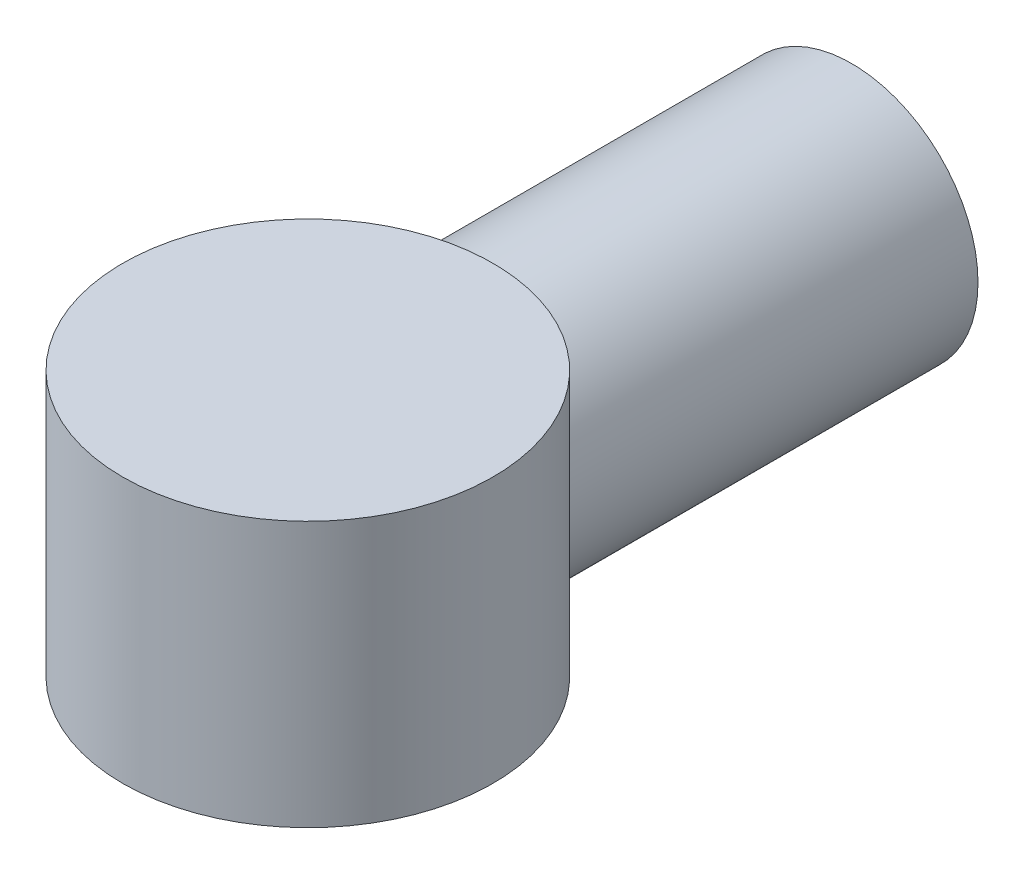
ISO-10303-21;
HEADER;
FILE_DESCRIPTION(('STEP AP214'),'2;1');
FILE_NAME('part.step','',(''),(''),'','','');
FILE_SCHEMA(('AUTOMOTIVE_DESIGN { 1 0 10303 214 1 1 1 1 }'));
ENDSEC;
DATA;
#1=APPLICATION_CONTEXT('core data for automotive mechanical design processes');
#2=APPLICATION_PROTOCOL_DEFINITION('international standard','automotive_design',2000,#1);
#3=PRODUCT_CONTEXT('',#1,'mechanical');
#4=PRODUCT('Part','Part','',(#3));
#5=PRODUCT_RELATED_PRODUCT_CATEGORY('part','',(#4));
#6=PRODUCT_DEFINITION_FORMATION('','',#4);
#7=PRODUCT_DEFINITION_CONTEXT('part definition',#1,'design');
#8=PRODUCT_DEFINITION('design','',#6,#7);
#9=PRODUCT_DEFINITION_SHAPE('','',#8);
#10=(LENGTH_UNIT() NAMED_UNIT(*) SI_UNIT(.MILLI.,.METRE.));
#11=(NAMED_UNIT(*) PLANE_ANGLE_UNIT() SI_UNIT($,.RADIAN.));
#12=(NAMED_UNIT(*) SI_UNIT($,.STERADIAN.) SOLID_ANGLE_UNIT());
#13=UNCERTAINTY_MEASURE_WITH_UNIT(LENGTH_MEASURE(1.E-05),#10,'distance_accuracy_value','');
#14=(GEOMETRIC_REPRESENTATION_CONTEXT(3) GLOBAL_UNCERTAINTY_ASSIGNED_CONTEXT((#13)) GLOBAL_UNIT_ASSIGNED_CONTEXT((#10,
#11,#12)) REPRESENTATION_CONTEXT('',''));
#15=CARTESIAN_POINT('',(0.,0.,0.));
#16=DIRECTION('',(0.,0.,1.));
#17=DIRECTION('',(1.,0.,0.));
#18=AXIS2_PLACEMENT_3D('',#15,#16,#17);
#19=CARTESIAN_POINT('',(0.,25.,102.473472637417));
#20=DIRECTION('',(0.,-1.,0.));
#21=DIRECTION('',(0.,0.,-1.));
#22=AXIS2_PLACEMENT_3D('',#19,#20,#21);
#23=CYLINDRICAL_SURFACE('',#22,34.8869608064512);
#24=CARTESIAN_POINT('',(0.,25.,102.473472637417));
#25=DIRECTION('',(0.,1.,0.));
#26=DIRECTION('',(0.,0.,1.));
#27=AXIS2_PLACEMENT_3D('',#24,#25,#26);
#28=CIRCLE('',#27,34.8869608064512);
#29=CARTESIAN_POINT('',(0.,25.,137.360433443868));
#30=VERTEX_POINT('',#29);
#31=EDGE_CURVE('E92',#30,#30,#28,.T.);
#32=ORIENTED_EDGE('',*,*,#31,.F.);
#33=EDGE_LOOP('',(#32));
#34=FACE_BOUND('',#33,.T.);
#35=CARTESIAN_POINT('',(0.,-25.,102.473472637417));
#36=DIRECTION('',(0.,1.,0.));
#37=DIRECTION('',(0.,0.,1.));
#38=AXIS2_PLACEMENT_3D('',#35,#36,#37);
#39=CIRCLE('',#38,34.8869608064512);
#40=CARTESIAN_POINT('',(0.,-25.,137.360433443868));
#41=VERTEX_POINT('',#40);
#42=EDGE_CURVE('E61',#41,#41,#39,.T.);
#43=ORIENTED_EDGE('',*,*,#42,.T.);
#44=EDGE_LOOP('',(#43));
#45=FACE_BOUND('',#44,.T.);
#46=CARTESIAN_POINT('',(-23.8,0.,76.9654340160164));
#47=CARTESIAN_POINT('',(-23.7999934232789,-0.576418801419144,76.9654224864551));
#48=CARTESIAN_POINT('',(-23.7790111165442,-1.1529411964045,76.9458005797443));
#49=CARTESIAN_POINT('',(-23.6955530417179,-2.30042789828507,76.8683186910635));
#50=CARTESIAN_POINT('',(-23.6330666952308,-2.8713907505308,76.8104489606488));
#51=CARTESIAN_POINT('',(-23.4678171923389,-4.00369020930131,76.6592501365312));
#52=CARTESIAN_POINT('',(-23.3649815951806,-4.56500759637919,76.5658572758954));
#53=CARTESIAN_POINT('',(-23.1209751010125,-5.67295265167801,76.3478681553006));
#54=CARTESIAN_POINT('',(-22.9798041055056,-6.21958028215185,76.2232718151688));
#55=CARTESIAN_POINT('',(-22.6629692548293,-7.28957490482201,75.9492726224235));
#56=CARTESIAN_POINT('',(-22.4876875019501,-7.81312723235293,75.8001471695467));
#57=CARTESIAN_POINT('',(-22.1036800383326,-8.84129983418151,75.4810727479273));
#58=CARTESIAN_POINT('',(-21.8949485950122,-9.34591684503167,75.3111202110321));
#59=CARTESIAN_POINT('',(-21.4458738152125,-10.3348634444718,74.9551772068326));
#60=CARTESIAN_POINT('',(-21.2055349141294,-10.8191958669979,74.7691889910343));
#61=CARTESIAN_POINT('',(-20.6947030232115,-11.7668631252132,74.3855507525045));
#62=CARTESIAN_POINT('',(-20.42420796103,-12.2301965147568,74.1878999287525));
#63=CARTESIAN_POINT('',(-19.8073785273959,-13.2096775066613,73.751827716536));
#64=CARTESIAN_POINT('',(-19.4558878071528,-13.7219785126137,73.5120472272838));
#65=CARTESIAN_POINT('',(-18.7151454002358,-14.7162391510908,73.0279433148781));
#66=CARTESIAN_POINT('',(-18.3258909859813,-15.1981965878206,72.7836195646077));
#67=CARTESIAN_POINT('',(-17.5103725108963,-16.1310584132851,72.2954515535117));
#68=CARTESIAN_POINT('',(-17.084068950002,-16.5819287170611,72.0516080950594));
#69=CARTESIAN_POINT('',(-16.1958736215276,-17.450488511825,71.5696039212662));
#70=CARTESIAN_POINT('',(-15.7339795742253,-17.8681758738179,71.3314435712343));
#71=CARTESIAN_POINT('',(-14.7014037081394,-18.7304137333746,70.8294017930397));
#72=CARTESIAN_POINT('',(-14.1249532477419,-19.16910365332,70.5672504429124));
#73=CARTESIAN_POINT('',(-12.9280824386725,-19.9958457298979,70.0638072343948));
#74=CARTESIAN_POINT('',(-12.3076545774704,-20.3838892024214,69.8225189556852));
#75=CARTESIAN_POINT('',(-11.026616307814,-21.1043236405197,69.3679670011689));
#76=CARTESIAN_POINT('',(-10.366068847461,-21.4367988673429,69.1546610018885));
#77=CARTESIAN_POINT('',(-9.34817424997351,-21.8904026671497,68.8604302193373));
#78=CARTESIAN_POINT('',(-9.00439806679816,-22.0340741495979,68.7666490848259));
#79=CARTESIAN_POINT('',(-8.30827765558709,-22.3058769027705,68.5883484701637));
#80=CARTESIAN_POINT('',(-7.95593131729409,-22.4340042985538,68.5038312999048));
#81=CARTESIAN_POINT('',(-7.07131721274117,-22.7320750284092,68.3063915983178));
#82=CARTESIAN_POINT('',(-6.53438113875734,-22.8923067623107,68.1994778877456));
#83=CARTESIAN_POINT('',(-5.44663349796937,-23.1752011828725,68.0098835953698));
#84=CARTESIAN_POINT('',(-4.89582475680757,-23.297871454294,67.9271981213197));
#85=CARTESIAN_POINT('',(-3.78400179446113,-23.5040581134994,67.7878126969488));
#86=CARTESIAN_POINT('',(-3.2229940030479,-23.5875983376159,67.7310969274806));
#87=CARTESIAN_POINT('',(-2.09434462225598,-23.7144725466885,67.6448339290833));
#88=CARTESIAN_POINT('',(-1.5267028130228,-23.7578051952988,67.6152876031628));
#89=CARTESIAN_POINT('',(-0.388011994390582,-23.8036694258833,67.5840125116054));
#90=CARTESIAN_POINT('',(0.183041219845814,-23.8061300284291,67.5823321386954));
#91=CARTESIAN_POINT('',(1.32323603275077,-23.7700313219602,67.6069521512566));
#92=CARTESIAN_POINT('',(1.89237763851074,-23.7314721652837,67.633252432814));
#93=CARTESIAN_POINT('',(3.02464219352566,-23.6138857493737,67.7132398737084));
#94=CARTESIAN_POINT('',(3.58776365336006,-23.5348487018522,67.7669336572789));
#95=CARTESIAN_POINT('',(4.70388069239944,-23.3374099811244,67.9005141360662));
#96=CARTESIAN_POINT('',(5.25687624094778,-23.2190081887604,67.9804009105696));
#97=CARTESIAN_POINT('',(6.33872572701026,-22.9470196826576,68.1628942983544));
#98=CARTESIAN_POINT('',(6.8678391539846,-22.7941498262457,68.2650367605406));
#99=CARTESIAN_POINT('',(7.91002706024392,-22.4537746582396,68.4908914563474));
#100=CARTESIAN_POINT('',(8.4231018532541,-22.2662700246185,68.614603267747));
#101=CARTESIAN_POINT('',(9.43087569518658,-21.8585017677894,68.8813551872887));
#102=CARTESIAN_POINT('',(9.92557359306053,-21.6382360968826,69.0243965035527));
#103=CARTESIAN_POINT('',(10.8946720655486,-21.166873069215,69.3273724597381));
#104=CARTESIAN_POINT('',(11.3690714309199,-20.9157738790502,69.4873081041408));
#105=CARTESIAN_POINT('',(12.3483078153223,-20.3546700619999,69.8403630774304));
#106=CARTESIAN_POINT('',(12.8505529617971,-20.0412161757087,70.0351909414737));
#107=CARTESIAN_POINT('',(13.8264830282277,-19.380804964732,70.4390012663528));
#108=CARTESIAN_POINT('',(14.3001661274048,-19.0338455077873,70.6479846277764));
#109=CARTESIAN_POINT('',(15.2182390036362,-18.3081383559605,71.0766236441966));
#110=CARTESIAN_POINT('',(15.6625987483969,-17.9293589470871,71.2962898524318));
#111=CARTESIAN_POINT('',(16.5205469468131,-17.142070068087,71.7422935444564));
#112=CARTESIAN_POINT('',(16.9341338594714,-16.7335591111305,71.9686313615457));
#113=CARTESIAN_POINT('',(17.7976142375337,-15.8160260674958,72.4629282957196));
#114=CARTESIAN_POINT('',(18.2416530524689,-15.3017504505741,72.731396727088));
#115=CARTESIAN_POINT('',(19.0849393108366,-14.2361151224849,73.2653522812956));
#116=CARTESIAN_POINT('',(19.4841777806016,-13.6847480170119,73.5308387972971));
#117=CARTESIAN_POINT('',(20.2359085468255,-12.5464308029138,74.0513535408443));
#118=CARTESIAN_POINT('',(20.5884156874895,-11.9594920803528,74.3063850715488));
#119=CARTESIAN_POINT('',(21.0802146355364,-11.0536216275783,74.6747923714575));
#120=CARTESIAN_POINT('',(21.2379741645693,-10.7474512114712,74.7952274276563));
#121=CARTESIAN_POINT('',(21.5408959020612,-10.1266541785027,75.0303207943079));
#122=CARTESIAN_POINT('',(21.6860549962364,-9.81202549614617,75.1449776737243));
#123=CARTESIAN_POINT('',(22.0363551154858,-9.00669786344431,75.4258722331339));
#124=CARTESIAN_POINT('',(22.2328176809062,-8.51054799640187,75.5874687807705));
#125=CARTESIAN_POINT('',(22.5935382672858,-7.50062973781419,75.8898781260107));
#126=CARTESIAN_POINT('',(22.7578044848251,-6.98686586969414,76.0306962111548));
#127=CARTESIAN_POINT('',(23.0521001813054,-5.94420660658114,76.2868583049628));
#128=CARTESIAN_POINT('',(23.1821805744406,-5.4153350296134,76.4022401549563));
#129=CARTESIAN_POINT('',(23.4065146859012,-4.3444535921483,76.6034535830092));
#130=CARTESIAN_POINT('',(23.5007687655733,-3.80244386422189,76.6892854591108));
#131=CARTESIAN_POINT('',(23.6524247807304,-2.70419582407584,76.8283250164302));
#132=CARTESIAN_POINT('',(23.7094986173644,-2.14787470417389,76.881242059334));
#133=CARTESIAN_POINT('',(23.7842815130469,-1.03030857033748,76.9507251154809));
#134=CARTESIAN_POINT('',(23.8019914464091,-0.469063666043406,76.9672919361006));
#135=CARTESIAN_POINT('',(23.7976527066048,0.653119380017923,76.9632440790626));
#136=CARTESIAN_POINT('',(23.7756048783285,1.21405752805064,76.9426301915303));
#137=CARTESIAN_POINT('',(23.6922414729451,2.33045411274277,76.8652527139465));
#138=CARTESIAN_POINT('',(23.630926840338,2.88591268087836,76.8084899933972));
#139=CARTESIAN_POINT('',(23.4797373200805,3.92213665353809,76.6701576689596));
#140=CARTESIAN_POINT('',(23.3940546053934,4.40402291016964,76.5922775150484));
#141=CARTESIAN_POINT('',(23.1942603637191,5.35758087067876,76.4130751229642));
#142=CARTESIAN_POINT('',(23.0801384992749,5.82924879234222,76.311744361596));
#143=CARTESIAN_POINT('',(22.8247577699404,6.76044932188342,76.0886440734891));
#144=CARTESIAN_POINT('',(22.683485643929,7.21997587422256,75.9668645625636));
#145=CARTESIAN_POINT('',(22.3751617213182,8.12532626198566,75.7060867295689));
#146=CARTESIAN_POINT('',(22.2081041883875,8.57114702183173,75.5670845774384));
#147=CARTESIAN_POINT('',(21.7676576972424,9.64804628956608,75.2084333248268));
#148=CARTESIAN_POINT('',(21.480514696295,10.2709202876238,74.9809085702822));
#149=CARTESIAN_POINT('',(20.8574299037837,11.4835837808781,74.5052525023245));
#150=CARTESIAN_POINT('',(20.5214697042056,12.0733606789931,74.2571134308379));
#151=CARTESIAN_POINT('',(19.8027323711794,13.2193008654367,73.7481172166431));
#152=CARTESIAN_POINT('',(19.4198811731219,13.775408848522,73.4872403556759));
#153=CARTESIAN_POINT('',(18.6097503941218,14.8516259763897,72.9605830442137));
#154=CARTESIAN_POINT('',(18.1824757158153,15.3717390830858,72.694803137483));
#155=CARTESIAN_POINT('',(17.2783306182021,16.381864046943,72.1611160958106));
#156=CARTESIAN_POINT('',(16.8008215639262,16.8713186838608,71.8932354167575));
#157=CARTESIAN_POINT('',(15.8029197277101,17.8094548626322,71.3658164668987));
#158=CARTESIAN_POINT('',(15.2825237796367,18.2581333890306,71.1062788139881));
#159=CARTESIAN_POINT('',(14.2011651366375,19.111267045626,70.6021321185891));
#160=CARTESIAN_POINT('',(13.6402589248925,19.5157818480859,70.3575031347296));
#161=CARTESIAN_POINT('',(12.4792953905597,20.277796559249,69.8888314807337));
#162=CARTESIAN_POINT('',(11.8792463557827,20.6353063724095,69.6647844767599));
#163=CARTESIAN_POINT('',(10.7505102967853,21.2415253225651,69.2798340154042));
#164=CARTESIAN_POINT('',(10.2275969162308,21.4983391268409,69.1147293724773));
#165=CARTESIAN_POINT('',(9.15907423957206,21.9748362980094,68.8056754965813));
#166=CARTESIAN_POINT('',(8.61346735390059,22.1945235958764,68.6617240241143));
#167=CARTESIAN_POINT('',(7.50250207252844,22.5942643938575,68.397993682423));
#168=CARTESIAN_POINT('',(6.93715282474016,22.7743359753847,68.2782037874522));
#169=CARTESIAN_POINT('',(5.7898348835558,23.092686860989,68.0653602214691));
#170=CARTESIAN_POINT('',(5.2078659924592,23.2309656676893,67.9723068686496));
#171=CARTESIAN_POINT('',(4.02839050368072,23.4643400347754,67.8147388140668));
#172=CARTESIAN_POINT('',(3.43082037668806,23.5592144289078,67.7503703175464));
#173=CARTESIAN_POINT('',(2.22766767264948,23.7032602523401,67.6524763561897));
#174=CARTESIAN_POINT('',(1.62208507651964,23.7524315727655,67.6189509648282));
#175=CARTESIAN_POINT('',(0.408117089163109,23.8042533327557,67.5836152068813));
#176=CARTESIAN_POINT('',(-0.20026775994007,23.8069124212439,67.5817989440012));
#177=CARTESIAN_POINT('',(-1.4146938105416,23.7656836728401,67.6099168754353));
#178=CARTESIAN_POINT('',(-2.02073514502577,23.7217985172506,67.6398492407868));
#179=CARTESIAN_POINT('',(-3.17511174789239,23.5937983487534,67.7268846208052));
#180=CARTESIAN_POINT('',(-3.72404606060242,23.5133418707181,67.7815146793293));
#181=CARTESIAN_POINT('',(-4.81198123834891,23.3150281410025,67.9156192224869));
#182=CARTESIAN_POINT('',(-5.35098275874637,23.1971733662602,67.9950920617452));
#183=CARTESIAN_POINT('',(-6.41586466746145,22.9255032874084,68.1772835021058));
#184=CARTESIAN_POINT('',(-6.94174347366962,22.7716836702424,68.2800048912253));
#185=CARTESIAN_POINT('',(-7.97752988333861,22.4298127928596,68.5067216358073));
#186=CARTESIAN_POINT('',(-8.48743665704361,22.2417597576436,68.6307180943606));
#187=CARTESIAN_POINT('',(-9.51318226811926,21.8234011335735,68.9042216856573));
#188=CARTESIAN_POINT('',(-10.028113813175,21.5914910926157,69.0546730400648));
#189=CARTESIAN_POINT('',(-11.0357028008993,21.0942867455731,69.3737352176746));
#190=CARTESIAN_POINT('',(-11.5283597984137,20.8289917726949,69.5423464035714));
#191=CARTESIAN_POINT('',(-12.4897842709057,20.2670999571635,69.8948370589099));
#192=CARTESIAN_POINT('',(-12.9585501726249,19.9705010570472,70.078717531762));
#193=CARTESIAN_POINT('',(-13.8709383481807,19.3479239588065,70.4587666137434));
#194=CARTESIAN_POINT('',(-14.3145576644838,19.0219423165565,70.6549366625827));
#195=CARTESIAN_POINT('',(-15.2435209437302,18.2887460018305,71.0881660727127));
#196=CARTESIAN_POINT('',(-15.7244237818005,17.8768253109132,71.3267975025266));
#197=CARTESIAN_POINT('',(-16.649970269136,17.0181400831517,71.8115824508825));
#198=CARTESIAN_POINT('',(-17.0946105434641,16.5713723106617,72.057736666642));
#199=CARTESIAN_POINT('',(-17.9474288694022,15.643771264855,72.5530203628534));
#200=CARTESIAN_POINT('',(-18.3555262701828,15.1628666469621,72.802155112344));
#201=CARTESIAN_POINT('',(-19.13298135753,14.169228331962,73.2974288529415));
#202=CARTESIAN_POINT('',(-19.5023372516065,13.6564931638661,73.5435677049689));
#203=CARTESIAN_POINT('',(-20.2481543595092,12.5287269154313,74.0596610284473));
#204=CARTESIAN_POINT('',(-20.6188113339861,11.9092429952493,74.3283300110698));
#205=CARTESIAN_POINT('',(-21.3055393683675,10.6320262303014,74.8445266967597));
#206=CARTESIAN_POINT('',(-21.6215944929223,9.97428229410221,75.0920482174004));
#207=CARTESIAN_POINT('',(-22.1942627831652,8.62492903321618,75.5541531477789));
#208=CARTESIAN_POINT('',(-22.4510835525252,7.9334486025017,75.768850677943));
#209=CARTESIAN_POINT('',(-22.7891082531988,6.8727214099843,76.0579742661914));
#210=CARTESIAN_POINT('',(-22.8938995067005,6.51530022333918,76.1488471015774));
#211=CARTESIAN_POINT('',(-23.087188312846,5.79321564804224,76.3182001152579));
#212=CARTESIAN_POINT('',(-23.1756888665667,5.42855360704308,76.3966825757304));
#213=CARTESIAN_POINT('',(-23.3450824994391,4.65012375833467,76.548165320795));
#214=CARTESIAN_POINT('',(-23.4238996599105,4.23556984102833,76.6194714340324));
#215=CARTESIAN_POINT('',(-23.5596848166813,3.40005650726203,76.7431455328398));
#216=CARTESIAN_POINT('',(-23.6166513574851,2.979096666037,76.7955122568214));
#217=CARTESIAN_POINT('',(-23.7080525563766,2.13288920553287,76.8798762181874));
#218=CARTESIAN_POINT('',(-23.7424979886499,1.70764373553374,76.9118831955544));
#219=CARTESIAN_POINT('',(-23.7884720075606,0.854950886617269,76.9546643856077));
#220=CARTESIAN_POINT('',(-23.8000048776587,0.427503934246384,76.9654425669743));
#221=CARTESIAN_POINT('',(-23.8,0.,76.9654340160164));
#222=B_SPLINE_CURVE_WITH_KNOTS('',3,(#46,#47,#48,#49,#50,#51,#52,#53,#54,#55,#56,#57,#58,#59,
#60,#61,#62,#63,#64,#65,#66,#67,#68,#69,#70,#71,#72,#73,#74,#75,#76,#77,#78,#79,#80,#81,#82,#83,
#84,#85,#86,#87,#88,#89,#90,#91,#92,#93,#94,#95,#96,#97,#98,#99,#100,#101,#102,#103,#104,#105,
#106,#107,#108,#109,#110,#111,#112,#113,#114,#115,#116,#117,#118,#119,#120,#121,#122,#123,#124,
#125,#126,#127,#128,#129,#130,#131,#132,#133,#134,#135,#136,#137,#138,#139,#140,#141,#142,#143,
#144,#145,#146,#147,#148,#149,#150,#151,#152,#153,#154,#155,#156,#157,#158,#159,#160,#161,#162,
#163,#164,#165,#166,#167,#168,#169,#170,#171,#172,#173,#174,#175,#176,#177,#178,#179,#180,#181,
#182,#183,#184,#185,#186,#187,#188,#189,#190,#191,#192,#193,#194,#195,#196,#197,#198,#199,#200,
#201,#202,#203,#204,#205,#206,#207,#208,#209,#210,#211,#212,#213,#214,#215,#216,#217,#218,#219,
#220,#221),.UNSPECIFIED.,.T.,.F.,(4,2,2,2,2,2,2,2,2,2,2,2,2,2,2,2,2,2,2,2,2,2,2,2,2,2,2,2,2,2,2,
2,2,2,2,2,2,2,2,2,2,2,2,2,2,2,2,2,2,2,2,2,2,2,2,2,2,2,2,2,2,2,2,2,2,2,2,2,2,2,2,2,2,2,2,2,2,2,2,
2,2,2,2,2,2,2,2,4),(0.,1.72873561587331,3.45791201462044,5.19020718897562,6.92250681424603,
8.63641559826065,10.3506184253807,12.0645809588391,13.7786613493665,15.7746497489281,
17.77078242141,19.7690700160479,21.7674857160884,24.0754498214858,26.3838091442289,
28.6886357751461,29.8408282201133,30.9933073042085,32.7026866286872,34.411720551357,
36.1197120461878,37.8277603060878,39.5387744962662,41.2497823321454,42.9612041162408,
44.6726310808839,46.3512994949207,48.0299350526353,49.7086755760635,51.387515968123,
53.2554894928936,55.1235819719729,56.9935589292416,58.8636294655681,61.0529367471517,
63.2426817748918,65.4317295549531,66.5260466804873,67.6206335084412,69.2917620550382,
70.9624646097958,72.6306646415606,74.2988478472994,75.9815594628825,77.6642337033026,
79.346872185717,81.0294701964863,82.5147617910072,84.0005940694729,85.487153932475,
86.9740449798215,89.1388230029146,91.3044194502115,93.4734816838119,95.6423047903223,
97.8431213642296,100.044100559641,102.242068082227,104.439571724618,106.254333536037,
108.068903078961,109.882642689503,111.696403884549,113.51930685059,115.342214159163,
117.16478249554,118.987245843817,120.657787847617,122.328219232323,123.99885104509,
125.669569504633,127.421147543777,129.172760572538,130.924488798544,132.676422622692,
134.704432983453,136.73263187515,138.765202054356,140.797866234978,143.105640215815,
145.41408657841,147.714315039283,148.863979028726,150.013431014348,151.296325122192,
152.579304670299,153.861669986048,155.143795543434),.UNSPECIFIED.);
#223=CARTESIAN_POINT('',(-23.8,0.,76.9654340160164));
#224=VERTEX_POINT('',#223);
#225=EDGE_CURVE('E10',#224,#224,#222,.T.);
#226=ORIENTED_EDGE('',*,*,#225,.T.);
#227=EDGE_LOOP('',(#226));
#228=FACE_BOUND('',#227,.T.);
#229=ADVANCED_FACE('F36',(#34,#45,#228),#23,.T.);
#230=CARTESIAN_POINT('',(0.,25.,102.473472637417));
#231=DIRECTION('',(0.,1.,0.));
#232=DIRECTION('',(0.,0.,1.));
#233=AXIS2_PLACEMENT_3D('',#230,#231,#232);
#234=PLANE('',#233);
#235=ORIENTED_EDGE('',*,*,#31,.T.);
#236=EDGE_LOOP('',(#235));
#237=FACE_BOUND('',#236,.T.);
#238=ADVANCED_FACE('F83',(#237),#234,.T.);
#239=CARTESIAN_POINT('',(0.,-25.,102.473472637417));
#240=DIRECTION('',(0.,1.,0.));
#241=DIRECTION('',(0.,0.,1.));
#242=AXIS2_PLACEMENT_3D('',#239,#240,#241);
#243=PLANE('',#242);
#244=ORIENTED_EDGE('',*,*,#42,.F.);
#245=EDGE_LOOP('',(#244));
#246=FACE_BOUND('',#245,.T.);
#247=ADVANCED_FACE('F69',(#246),#243,.F.);
#248=CARTESIAN_POINT('',(0.,0.,80.));
#249=DIRECTION('',(0.,0.,-1.));
#250=DIRECTION('',(-1.,0.,0.));
#251=AXIS2_PLACEMENT_3D('',#248,#249,#250);
#252=CYLINDRICAL_SURFACE('',#251,23.8);
#253=CARTESIAN_POINT('',(0.,0.,0.));
#254=DIRECTION('',(0.,0.,1.));
#255=DIRECTION('',(1.,0.,0.));
#256=AXIS2_PLACEMENT_3D('',#253,#254,#255);
#257=CIRCLE('',#256,23.8);
#258=CARTESIAN_POINT('',(23.8,0.,0.));
#259=VERTEX_POINT('',#258);
#260=EDGE_CURVE('E50',#259,#259,#257,.T.);
#261=ORIENTED_EDGE('',*,*,#260,.T.);
#262=EDGE_LOOP('',(#261));
#263=FACE_BOUND('',#262,.T.);
#264=ORIENTED_EDGE('',*,*,#225,.F.);
#265=EDGE_LOOP('',(#264));
#266=FACE_BOUND('',#265,.T.);
#267=ADVANCED_FACE('F38',(#263,#266),#252,.T.);
#268=CARTESIAN_POINT('',(0.,0.,80.));
#269=DIRECTION('',(0.,0.,-1.));
#270=DIRECTION('',(-1.,0.,0.));
#271=AXIS2_PLACEMENT_3D('',#268,#269,#270);
#272=CYLINDRICAL_SURFACE('',#271,19.);
#273=CARTESIAN_POINT('',(0.,0.,0.));
#274=DIRECTION('',(0.,0.,1.));
#275=DIRECTION('',(1.,0.,0.));
#276=AXIS2_PLACEMENT_3D('',#273,#274,#275);
#277=CIRCLE('',#276,19.);
#278=CARTESIAN_POINT('',(19.,0.,0.));
#279=VERTEX_POINT('',#278);
#280=EDGE_CURVE('E55',#279,#279,#277,.T.);
#281=ORIENTED_EDGE('',*,*,#280,.F.);
#282=EDGE_LOOP('',(#281));
#283=FACE_BOUND('',#282,.T.);
#284=CARTESIAN_POINT('',(-19.,0.,73.214285459526));
#285=CARTESIAN_POINT('',(-19.0000041221513,-0.488015720927359,73.2142908645628));
#286=CARTESIAN_POINT('',(-18.9811757706332,-0.97598558772951,73.2020364684778));
#287=CARTESIAN_POINT('',(-18.9061599866318,-1.94801667178813,73.1535278133211));
#288=CARTESIAN_POINT('',(-18.8499597284938,-2.43207648941135,73.1172653149338));
#289=CARTESIAN_POINT('',(-18.7009241549055,-3.39296602109567,73.0221017349277));
#290=CARTESIAN_POINT('',(-18.6080345835605,-3.86978393651353,72.9631671293326));
#291=CARTESIAN_POINT('',(-18.3869067059098,-4.81205452008513,72.8248865378558));
#292=CARTESIAN_POINT('',(-18.2586704319365,-5.27750783999552,72.7455417255191));
#293=CARTESIAN_POINT('',(-17.9692725394776,-6.19141348912797,72.5697317048933));
#294=CARTESIAN_POINT('',(-17.8083196914151,-6.63995323609034,72.4733755377545));
#295=CARTESIAN_POINT('',(-17.4545896725056,-7.52081027413803,72.2662000848708));
#296=CARTESIAN_POINT('',(-17.2618121586817,-7.9531273903292,72.1553806432569));
#297=CARTESIAN_POINT('',(-16.8459788240165,-8.79974085012178,71.9223710150822));
#298=CARTESIAN_POINT('',(-16.6229219882485,-9.21403658905323,71.8001804474182));
#299=CARTESIAN_POINT('',(-16.1479734830827,-10.0231256240607,71.5475071431366));
#300=CARTESIAN_POINT('',(-15.8960790318667,-10.4179170333856,71.4170236070796));
#301=CARTESIAN_POINT('',(-15.338437088574,-11.224798801279,71.1375663455688));
#302=CARTESIAN_POINT('',(-15.0298262930886,-11.6347220316918,70.9880422147438));
#303=CARTESIAN_POINT('',(-14.3811347292339,-12.4276006276354,70.6865116954403));
#304=CARTESIAN_POINT('',(-14.0410647579846,-12.8105651667918,70.5345061732436));
#305=CARTESIAN_POINT('',(-13.3306185245426,-13.5483224121037,70.2315144309661));
#306=CARTESIAN_POINT('',(-12.9602197851937,-13.9030938330777,70.0805290583007));
#307=CARTESIAN_POINT('',(-12.1908753074551,-14.582383442922,69.783219054087));
#308=CARTESIAN_POINT('',(-11.7919284815758,-14.9069004782187,69.6368946003955));
#309=CARTESIAN_POINT('',(-10.9325157807846,-15.5496504072302,69.3403523431259));
#310=CARTESIAN_POINT('',(-10.4696966922215,-15.8650721203434,69.1908377591636));
#311=CARTESIAN_POINT('',(-9.5148807406197,-16.4554579623894,68.9054021935031));
#312=CARTESIAN_POINT('',(-9.02288181136197,-16.7304192215146,68.7694821762685));
#313=CARTESIAN_POINT('',(-8.01298853091187,-17.2369051059809,68.5152191275413));
#314=CARTESIAN_POINT('',(-7.49510916269305,-17.4684545031152,68.3968660800191));
#315=CARTESIAN_POINT('',(-6.43688901621778,-17.8854622073848,68.1812298259264));
#316=CARTESIAN_POINT('',(-5.89655116776865,-18.0709265046321,68.0839438812787));
#317=CARTESIAN_POINT('',(-4.84282137841126,-18.3799728861128,67.9205030849909));
#318=CARTESIAN_POINT('',(-4.33084348280659,-18.5073773291344,67.8524520078998));
#319=CARTESIAN_POINT('',(-3.2956605086594,-18.7194468286592,67.7386241993393));
#320=CARTESIAN_POINT('',(-2.77245599237031,-18.8041140203523,67.6928463550841));
#321=CARTESIAN_POINT('',(-1.71960458153653,-18.9294438819067,67.6249273793005));
#322=CARTESIAN_POINT('',(-1.18996189251689,-18.9701338647356,67.6027715769234));
#323=CARTESIAN_POINT('',(-0.128686882392629,-19.0069798409946,67.582713688359));
#324=CARTESIAN_POINT('',(0.402945282251011,-19.0031392658602,67.5848097333729));
#325=CARTESIAN_POINT('',(1.40875960568508,-18.9536873472467,67.611717573998));
#326=CARTESIAN_POINT('',(1.88322591928257,-18.9124134978543,67.6341704775455));
#327=CARTESIAN_POINT('',(2.8264354202514,-18.7946029589354,67.6979830693986));
#328=CARTESIAN_POINT('',(3.29517908529451,-18.7180692335098,67.7393411684478));
#329=CARTESIAN_POINT('',(4.22377504542404,-18.5306264323281,67.8399930325523));
#330=CARTESIAN_POINT('',(4.68362703001316,-18.4197161584384,67.8992874227435));
#331=CARTESIAN_POINT('',(5.59153610015569,-18.1647207328162,68.0344623030178));
#332=CARTESIAN_POINT('',(6.03959272962247,-18.0206343003668,68.1103434334019));
#333=CARTESIAN_POINT('',(6.92622977494919,-17.6989328052828,68.2779582633988));
#334=CARTESIAN_POINT('',(7.36464985017208,-17.5209634064362,68.3698585404557));
#335=CARTESIAN_POINT('',(8.22452167384849,-17.1341622057242,68.5669561034339));
#336=CARTESIAN_POINT('',(8.64597349598088,-16.9253305378862,68.6721533316095));
#337=CARTESIAN_POINT('',(9.47008003905182,-16.4783908767576,68.8937208503312));
#338=CARTESIAN_POINT('',(9.87273098633185,-16.2402770405878,69.0100933697444));
#339=CARTESIAN_POINT('',(10.6575558513503,-15.7363913657645,69.2517151832112));
#340=CARTESIAN_POINT('',(11.039727899789,-15.4706170087705,69.3769652851891));
#341=CARTESIAN_POINT('',(11.8217438771376,-14.8832221509585,69.6476393901331));
#342=CARTESIAN_POINT('',(12.2191354286999,-14.5586685119325,69.7937913219459));
#343=CARTESIAN_POINT('',(12.985478202905,-13.8794652469296,70.0906640763849));
#344=CARTESIAN_POINT('',(13.3544276701852,-13.5248137662347,70.2413851802085));
#345=CARTESIAN_POINT('',(14.062682131967,-12.7868203585149,70.5440277916235));
#346=CARTESIAN_POINT('',(14.4019587738433,-12.4034516273112,70.6959502992739));
#347=CARTESIAN_POINT('',(15.048949372352,-11.6099614863282,70.9971876070557));
#348=CARTESIAN_POINT('',(15.3566619649636,-11.1998389216504,71.1465022942606));
#349=CARTESIAN_POINT('',(15.9637081574717,-10.3184398466432,71.4511420903126));
#350=CARTESIAN_POINT('',(16.2600964688256,-9.84492978660871,71.6058961405759));
#351=CARTESIAN_POINT('',(16.811516151579,-8.87053009777732,71.9027176469765));
#352=CARTESIAN_POINT('',(17.0665441909098,-8.36963826739056,72.0447840805593));
#353=CARTESIAN_POINT('',(17.5324814714216,-7.34364985351143,72.3108453113713));
#354=CARTESIAN_POINT('',(17.7434311872963,-6.81857602063662,72.4348566555756));
#355=CARTESIAN_POINT('',(18.1188041363545,-5.74725374258614,72.6597685737127));
#356=CARTESIAN_POINT('',(18.2832347705363,-5.20100868140818,72.7606728234037));
#357=CARTESIAN_POINT('',(18.5516767780939,-4.13662649841988,72.9276055517591));
#358=CARTESIAN_POINT('',(18.6595001426182,-3.61979094266976,72.995795212927));
#359=CARTESIAN_POINT('',(18.8319684188363,-2.57615814670319,73.105675109284));
#360=CARTESIAN_POINT('',(18.8966160639717,-2.04936153928968,73.1473670220295));
#361=CARTESIAN_POINT('',(18.9815432020858,-0.99120598103193,73.202264425153));
#362=CARTESIAN_POINT('',(19.0018637618811,-0.45985171130706,73.2154962821832));
#363=CARTESIAN_POINT('',(18.9978681586472,0.602589175741591,73.2129005553855));
#364=CARTESIAN_POINT('',(18.9735566097777,1.13367581505588,73.1970759754721));
#365=CARTESIAN_POINT('',(18.8873485908731,2.11554469945233,73.1414048648017));
#366=CARTESIAN_POINT('',(18.8312521624273,2.56706432595124,73.1052710811291));
#367=CARTESIAN_POINT('',(18.6872659001313,3.46292758106421,73.0134416889224));
#368=CARTESIAN_POINT('',(18.5993797313258,3.90727203073908,72.9577483354362));
#369=CARTESIAN_POINT('',(18.392821339931,4.78623473893466,72.8285918282179));
#370=CARTESIAN_POINT('',(18.2741387132879,5.22084965649539,72.7551226698038));
#371=CARTESIAN_POINT('',(18.0072297692263,6.07792465935343,72.5926410814204));
#372=CARTESIAN_POINT('',(17.8590014329547,6.50038391179773,72.5036275893611));
#373=CARTESIAN_POINT('',(17.527387458782,7.34894255730938,72.3084386132641));
#374=CARTESIAN_POINT('',(17.3427725626234,7.77442955925006,72.2016933300945));
#375=CARTESIAN_POINT('',(16.9442381665762,8.60851569843845,71.9768306019355));
#376=CARTESIAN_POINT('',(16.7303065530915,9.01710776341681,71.8587084620836));
#377=CARTESIAN_POINT('',(16.2745368177715,9.81585042377884,71.614010901119));
#378=CARTESIAN_POINT('',(16.0326939414212,10.2059978612287,71.4874340413472));
#379=CARTESIAN_POINT('',(15.5223934190201,10.9665424133945,71.2286780483093));
#380=CARTESIAN_POINT('',(15.2539334493417,11.3369377994411,71.0964984265092));
#381=CARTESIAN_POINT('',(14.648004832381,12.1125629391581,70.8085834889328));
#382=CARTESIAN_POINT('',(14.306287457298,12.5143053029282,70.6523700367601));
#383=CARTESIAN_POINT('',(13.5905958218942,13.2880958123344,70.340184923151));
#384=CARTESIAN_POINT('',(13.2166186936629,13.6601413122298,70.1842132844693));
#385=CARTESIAN_POINT('',(12.4378546896102,14.3728391837311,69.8763071181443));
#386=CARTESIAN_POINT('',(12.0330500372508,14.7134731879163,69.7243749890339));
#387=CARTESIAN_POINT('',(11.1946295519635,15.3610160164467,69.4283833225942));
#388=CARTESIAN_POINT('',(10.7610153603118,15.6679267593634,69.2843233376403));
#389=CARTESIAN_POINT('',(9.84559127705882,16.2596225455175,69.0010258476068));
#390=CARTESIAN_POINT('',(9.36246860880591,16.5426505563966,68.8623473542755));
#391=CARTESIAN_POINT('',(8.36954373856005,17.0665109640874,68.6014453908181));
#392=CARTESIAN_POINT('',(7.85974016292739,17.3073411856074,68.4792227690657));
#393=CARTESIAN_POINT('',(6.8173395013114,17.7438119024727,68.2549416649183));
#394=CARTESIAN_POINT('',(6.28476168036607,17.9394897303276,68.1528665345224));
#395=CARTESIAN_POINT('',(5.20063567021121,18.2832330792159,67.9719472345707));
#396=CARTESIAN_POINT('',(4.64909024979773,18.431305517065,67.8930996903068));
#397=CARTESIAN_POINT('',(3.5883870817823,18.6651537013783,67.7678635714267));
#398=CARTESIAN_POINT('',(3.08057113742455,18.7557093508492,67.719001769108));
#399=CARTESIAN_POINT('',(2.05763111128657,18.8953049470539,67.6434695556583));
#400=CARTESIAN_POINT('',(1.54250753155305,18.9443477318805,67.6167976274834));
#401=CARTESIAN_POINT('',(0.509520042259061,19.0002063290109,67.5864072819604));
#402=CARTESIAN_POINT('',(-0.00834261741101646,19.0070399754255,67.5826791704445));
#403=CARTESIAN_POINT('',(-1.04253730955072,18.9784263424,67.598258703743));
#404=CARTESIAN_POINT('',(-1.558869412979,18.9429810548023,67.6175652633494));
#405=CARTESIAN_POINT('',(-2.54098817614918,18.8352291016292,67.6760005189247));
#406=CARTESIAN_POINT('',(-3.00727215476739,18.7663888981135,67.7132632787839));
#407=CARTESIAN_POINT('',(-3.9316949103352,18.5946969543155,67.8056554266839));
#408=CARTESIAN_POINT('',(-4.38983428186168,18.4918477076125,67.8607835048147));
#409=CARTESIAN_POINT('',(-5.29511188781587,18.2532447228263,67.9876671773181));
#410=CARTESIAN_POINT('',(-5.74224946046062,18.1174890106493,68.0594237692417));
#411=CARTESIAN_POINT('',(-6.62294322922588,17.8144189507934,68.2180075492956));
#412=CARTESIAN_POINT('',(-7.0564987750413,17.6471030947051,68.3048354577401));
#413=CARTESIAN_POINT('',(-7.9228335385631,17.2759533517986,68.4950630869319));
#414=CARTESIAN_POINT('',(-8.35504419117062,17.0710381520466,68.5989399003178));
#415=CARTESIAN_POINT('',(-9.20040925098167,16.6306836799508,68.8187066095728));
#416=CARTESIAN_POINT('',(-9.61356342504425,16.3952440342986,68.9345966523581));
#417=CARTESIAN_POINT('',(-10.419175226163,15.8954571373344,69.1760596797787));
#418=CARTESIAN_POINT('',(-10.8116270486816,15.6311018418214,69.3016353560333));
#419=CARTESIAN_POINT('',(-11.574249018912,15.0751280259916,69.5599659313509));
#420=CARTESIAN_POINT('',(-11.9444168151274,14.7835066367123,69.6927215852765));
#421=CARTESIAN_POINT('',(-12.7018594250686,14.1399080731392,69.9781707294199));
#422=CARTESIAN_POINT('',(-13.0863023238281,13.784837691971,70.1314162151676));
#423=CARTESIAN_POINT('',(-13.8242551455206,13.0446590736287,70.4398967603344));
#424=CARTESIAN_POINT('',(-14.1777627255876,12.6595485655559,70.5951319694249));
#425=CARTESIAN_POINT('',(-14.8526085240391,11.8605971407426,70.9039001596945));
#426=CARTESIAN_POINT('',(-15.1739081544634,11.4467227438069,71.0574309075758));
#427=CARTESIAN_POINT('',(-15.7821307911115,10.5924163682393,71.3585317262963));
#428=CARTESIAN_POINT('',(-16.069055485797,10.1519856956234,71.5061020896672));
#429=CARTESIAN_POINT('',(-16.6234963321291,9.21804612715301,71.7999674899336));
#430=CARTESIAN_POINT('',(-16.8886800387514,8.72294022530446,71.9456068675775));
#431=CARTESIAN_POINT('',(-17.3757194012947,7.70724331013529,72.2201647735084));
#432=CARTESIAN_POINT('',(-17.5975676010862,7.18664793043668,72.3490804231));
#433=CARTESIAN_POINT('',(-17.9946604711485,6.12474958228033,72.584587670125));
#434=CARTESIAN_POINT('',(-18.170033665151,5.58350855841139,72.6912406561683));
#435=CARTESIAN_POINT('',(-18.4722458119086,4.48343511879931,72.8777331828749));
#436=CARTESIAN_POINT('',(-18.5991161204417,3.92461432168209,72.9575900423972));
#437=CARTESIAN_POINT('',(-18.7997535945545,2.80775013310399,73.084986234842));
#438=CARTESIAN_POINT('',(-18.8747120802945,2.25000441023912,73.1332490846857));
#439=CARTESIAN_POINT('',(-18.9748329492202,1.12815204827894,73.1978956044476));
#440=CARTESIAN_POINT('',(-18.9999952356443,0.564045396825525,73.2142792124196));
#441=CARTESIAN_POINT('',(-19.,0.,73.214285459526));
#442=B_SPLINE_CURVE_WITH_KNOTS('',3,(#284,#285,#286,#287,#288,#289,#290,#291,#292,#293,#294,
#295,#296,#297,#298,#299,#300,#301,#302,#303,#304,#305,#306,#307,#308,#309,#310,#311,#312,#313,
#314,#315,#316,#317,#318,#319,#320,#321,#322,#323,#324,#325,#326,#327,#328,#329,#330,#331,#332,
#333,#334,#335,#336,#337,#338,#339,#340,#341,#342,#343,#344,#345,#346,#347,#348,#349,#350,#351,
#352,#353,#354,#355,#356,#357,#358,#359,#360,#361,#362,#363,#364,#365,#366,#367,#368,#369,#370,
#371,#372,#373,#374,#375,#376,#377,#378,#379,#380,#381,#382,#383,#384,#385,#386,#387,#388,#389,
#390,#391,#392,#393,#394,#395,#396,#397,#398,#399,#400,#401,#402,#403,#404,#405,#406,#407,#408,
#409,#410,#411,#412,#413,#414,#415,#416,#417,#418,#419,#420,#421,#422,#423,#424,#425,#426,#427,
#428,#429,#430,#431,#432,#433,#434,#435,#436,#437,#438,#439,#440,#441),.UNSPECIFIED.,.T.,.F.,(4,
2,2,2,2,2,2,2,2,2,2,2,2,2,2,2,2,2,2,2,2,2,2,2,2,2,2,2,2,2,2,2,2,2,2,2,2,2,2,2,2,2,2,2,2,2,2,2,2,
2,2,2,2,2,2,2,2,2,2,2,2,2,2,2,2,2,2,2,2,2,2,2,2,2,2,2,2,2,4),(0.,1.46345759827263,
2.92741769955385,4.39355084900815,5.85959971766035,7.31657166125651,8.77355930777523,
10.2305958028461,11.6877729694493,13.2894587363089,14.8905968129367,16.4929324506273,
18.0953291590294,19.8321563337659,21.5691066400836,23.3050627662894,25.0407931358518,
26.6344648033243,28.228056841707,29.8206585765932,31.4131375896013,32.8418022799507,
34.2703468923387,35.6989412997112,37.1275908651203,38.5720947339893,40.0165923299154,
41.4613786258267,42.9062965769658,44.5050924335545,46.1039868843052,47.7043927707549,
49.3048677886363,51.0416427444105,52.778557548927,54.5138703626007,56.2489069395495,
57.8435667317662,59.4381255569861,61.0312064750751,62.6241227064379,63.9918203024597,
65.3593602666157,66.72736283349,68.0954589078,69.521869649008,70.9488715668454,72.3761169256247,
73.8034869904227,75.451884552594,77.100428809585,78.7499309964111,80.3993392917201,
82.1275310265983,83.8558118233873,85.5826584965249,87.30925415431,88.8615476470056,
90.4137350061148,91.9652664935965,93.5167248883094,94.9335224238827,96.3502161013721,
97.7669947888666,99.1838412081214,100.650743437228,102.117663607966,103.584992912089,
105.052476784017,106.686628957872,108.320904786248,109.957115788777,111.59324638931,
113.331594046877,115.070240534477,116.804027507051,118.536691731146,120.228143220054,
121.919597995705),.UNSPECIFIED.);
#443=CARTESIAN_POINT('',(-19.,0.,73.214285459526));
#444=VERTEX_POINT('',#443);
#445=EDGE_CURVE('E41',#444,#444,#442,.T.);
#446=ORIENTED_EDGE('',*,*,#445,.T.);
#447=EDGE_LOOP('',(#446));
#448=FACE_BOUND('',#447,.T.);
#449=ADVANCED_FACE('F71',(#283,#448),#272,.F.);
#450=CARTESIAN_POINT('',(0.,0.,0.));
#451=DIRECTION('',(0.,0.,1.));
#452=DIRECTION('',(1.,0.,0.));
#453=AXIS2_PLACEMENT_3D('',#450,#451,#452);
#454=PLANE('',#453);
#455=ORIENTED_EDGE('',*,*,#260,.F.);
#456=EDGE_LOOP('',(#455));
#457=FACE_BOUND('',#456,.T.);
#458=ORIENTED_EDGE('',*,*,#280,.T.);
#459=EDGE_LOOP('',(#458));
#460=FACE_BOUND('',#459,.T.);
#461=ADVANCED_FACE('F67',(#457,#460),#454,.F.);
#462=ORIENTED_EDGE('',*,*,#445,.F.);
#463=EDGE_LOOP('',(#462));
#464=FACE_BOUND('',#463,.T.);
#465=ADVANCED_FACE('F63',(#464),#23,.T.);
#466=CLOSED_SHELL('',(#229,#238,#247,#267,#449,#461,#465));
#467=MANIFOLD_SOLID_BREP('B2',#466);
#468=ADVANCED_BREP_SHAPE_REPRESENTATION('',(#18,#467),#14);
#469=SHAPE_DEFINITION_REPRESENTATION(#9,#468);
ENDSEC;
END-ISO-10303-21;
